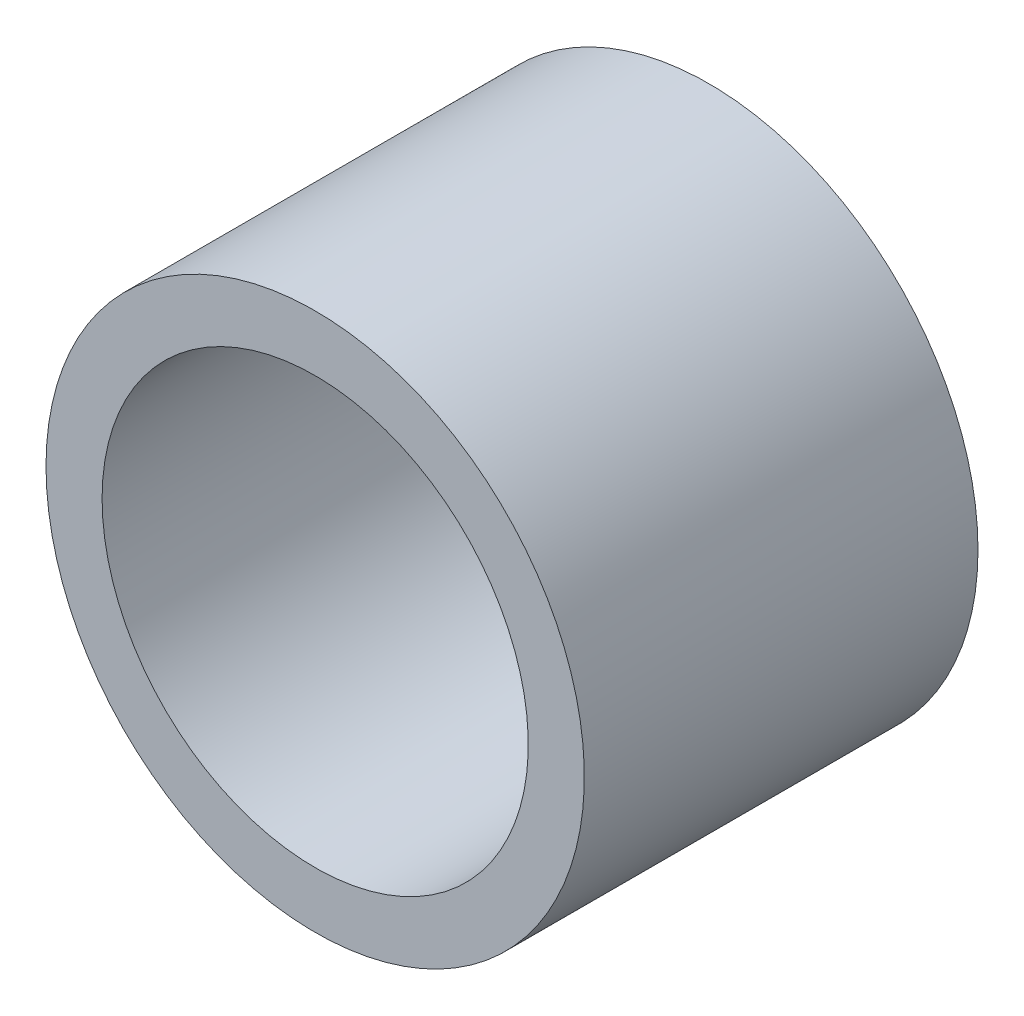
ISO-10303-21;
HEADER;
FILE_DESCRIPTION(('STEP AP214'),'2;1');
FILE_NAME('part.step','',(''),(''),'','','');
FILE_SCHEMA(('AUTOMOTIVE_DESIGN { 1 0 10303 214 1 1 1 1 }'));
ENDSEC;
DATA;
#1=APPLICATION_CONTEXT('core data for automotive mechanical design processes');
#2=APPLICATION_PROTOCOL_DEFINITION('international standard','automotive_design',2000,#1);
#3=PRODUCT_CONTEXT('',#1,'mechanical');
#4=PRODUCT('Part','Part','',(#3));
#5=PRODUCT_RELATED_PRODUCT_CATEGORY('part','',(#4));
#6=PRODUCT_DEFINITION_FORMATION('','',#4);
#7=PRODUCT_DEFINITION_CONTEXT('part definition',#1,'design');
#8=PRODUCT_DEFINITION('design','',#6,#7);
#9=PRODUCT_DEFINITION_SHAPE('','',#8);
#10=(LENGTH_UNIT() NAMED_UNIT(*) SI_UNIT(.MILLI.,.METRE.));
#11=(NAMED_UNIT(*) PLANE_ANGLE_UNIT() SI_UNIT($,.RADIAN.));
#12=(NAMED_UNIT(*) SI_UNIT($,.STERADIAN.) SOLID_ANGLE_UNIT());
#13=UNCERTAINTY_MEASURE_WITH_UNIT(LENGTH_MEASURE(1.E-05),#10,'distance_accuracy_value','');
#14=(GEOMETRIC_REPRESENTATION_CONTEXT(3) GLOBAL_UNCERTAINTY_ASSIGNED_CONTEXT((#13)) GLOBAL_UNIT_ASSIGNED_CONTEXT((#10,
#11,#12)) REPRESENTATION_CONTEXT('',''));
#15=CARTESIAN_POINT('',(0.,0.,0.));
#16=DIRECTION('',(0.,0.,1.));
#17=DIRECTION('',(1.,0.,0.));
#18=AXIS2_PLACEMENT_3D('',#15,#16,#17);
#19=CARTESIAN_POINT('',(24.835128068385,-26.,0.));
#20=DIRECTION('',(0.,0.,1.));
#21=DIRECTION('',(1.,0.,0.));
#22=AXIS2_PLACEMENT_3D('',#19,#20,#21);
#23=PLANE('',#22);
#24=CARTESIAN_POINT('',(24.835128068385,-26.,0.));
#25=DIRECTION('',(0.,0.,1.));
#26=DIRECTION('',(1.,0.,0.));
#27=AXIS2_PLACEMENT_3D('',#24,#25,#26);
#28=CIRCLE('',#27,12.);
#29=CARTESIAN_POINT('',(36.835128068385,-26.,0.));
#30=VERTEX_POINT('',#29);
#31=EDGE_CURVE('E46',#30,#30,#28,.T.);
#32=ORIENTED_EDGE('',*,*,#31,.F.);
#33=EDGE_LOOP('',(#32));
#34=FACE_BOUND('',#33,.T.);
#35=CARTESIAN_POINT('',(24.835128068385,-26.,0.));
#36=DIRECTION('',(0.,0.,1.));
#37=DIRECTION('',(1.,0.,0.));
#38=AXIS2_PLACEMENT_3D('',#35,#36,#37);
#39=CIRCLE('',#38,9.5);
#40=CARTESIAN_POINT('',(34.335128068385,-26.,0.));
#41=VERTEX_POINT('',#40);
#42=EDGE_CURVE('E55',#41,#41,#39,.T.);
#43=ORIENTED_EDGE('',*,*,#42,.T.);
#44=EDGE_LOOP('',(#43));
#45=FACE_BOUND('',#44,.T.);
#46=ADVANCED_FACE('F39',(#34,#45),#23,.F.);
#47=CARTESIAN_POINT('',(24.835128068385,-26.,51.4897281384255));
#48=DIRECTION('',(0.,0.,-1.));
#49=DIRECTION('',(-1.,0.,0.));
#50=AXIS2_PLACEMENT_3D('',#47,#48,#49);
#51=CYLINDRICAL_SURFACE('',#50,12.);
#52=CARTESIAN_POINT('',(24.835128068385,-26.,17.5486026414712));
#53=DIRECTION('',(0.,0.,-1.));
#54=DIRECTION('',(-1.,0.,0.));
#55=AXIS2_PLACEMENT_3D('',#52,#53,#54);
#56=CIRCLE('',#55,12.);
#57=CARTESIAN_POINT('',(12.835128068385,-26.,17.5486026414712));
#58=VERTEX_POINT('',#57);
#59=EDGE_CURVE('E50',#58,#58,#56,.T.);
#60=ORIENTED_EDGE('',*,*,#59,.T.);
#61=EDGE_LOOP('',(#60));
#62=FACE_BOUND('',#61,.T.);
#63=ORIENTED_EDGE('',*,*,#31,.T.);
#64=EDGE_LOOP('',(#63));
#65=FACE_BOUND('',#64,.T.);
#66=ADVANCED_FACE('F63',(#62,#65),#51,.T.);
#67=CARTESIAN_POINT('',(24.835128068385,-26.,51.4897281384255));
#68=DIRECTION('',(0.,0.,-1.));
#69=DIRECTION('',(-1.,0.,0.));
#70=AXIS2_PLACEMENT_3D('',#67,#68,#69);
#71=CYLINDRICAL_SURFACE('',#70,9.5);
#72=CARTESIAN_POINT('',(24.835128068385,-26.,17.5486026414712));
#73=DIRECTION('',(0.,0.,-1.));
#74=DIRECTION('',(-1.,0.,0.));
#75=AXIS2_PLACEMENT_3D('',#72,#73,#74);
#76=CIRCLE('',#75,9.5);
#77=CARTESIAN_POINT('',(15.335128068385,-26.,17.5486026414712));
#78=VERTEX_POINT('',#77);
#79=EDGE_CURVE('E10',#78,#78,#76,.T.);
#80=ORIENTED_EDGE('',*,*,#79,.F.);
#81=EDGE_LOOP('',(#80));
#82=FACE_BOUND('',#81,.T.);
#83=ORIENTED_EDGE('',*,*,#42,.F.);
#84=EDGE_LOOP('',(#83));
#85=FACE_BOUND('',#84,.T.);
#86=ADVANCED_FACE('F61',(#82,#85),#71,.F.);
#87=CARTESIAN_POINT('',(19.3351280683851,24.777384147396,17.5486026414712));
#88=DIRECTION('',(0.,0.,-1.));
#89=DIRECTION('',(1.,0.,0.));
#90=AXIS2_PLACEMENT_3D('',#87,#88,#89);
#91=PLANE('',#90);
#92=ORIENTED_EDGE('',*,*,#79,.T.);
#93=EDGE_LOOP('',(#92));
#94=FACE_BOUND('',#93,.T.);
#95=ORIENTED_EDGE('',*,*,#59,.F.);
#96=EDGE_LOOP('',(#95));
#97=FACE_BOUND('',#96,.T.);
#98=ADVANCED_FACE('F41',(#94,#97),#91,.F.);
#99=CLOSED_SHELL('',(#46,#66,#86,#98));
#100=MANIFOLD_SOLID_BREP('B2',#99);
#101=ADVANCED_BREP_SHAPE_REPRESENTATION('',(#18,#100),#14);
#102=SHAPE_DEFINITION_REPRESENTATION(#9,#101);
ENDSEC;
END-ISO-10303-21;
